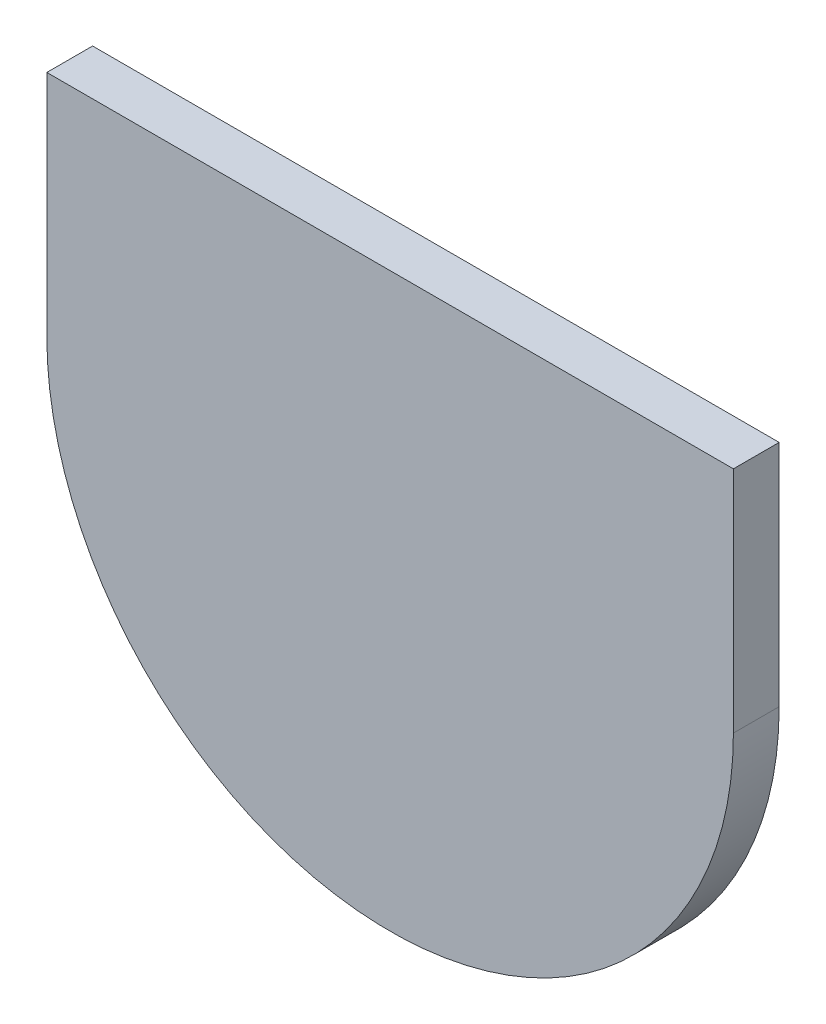
ISO-10303-21;
HEADER;
FILE_DESCRIPTION(('STEP AP214'),'2;1');
FILE_NAME('part.step','',(''),(''),'','','');
FILE_SCHEMA(('AUTOMOTIVE_DESIGN { 1 0 10303 214 1 1 1 1 }'));
ENDSEC;
DATA;
#1=APPLICATION_CONTEXT('core data for automotive mechanical design processes');
#2=APPLICATION_PROTOCOL_DEFINITION('international standard','automotive_design',2000,#1);
#3=PRODUCT_CONTEXT('',#1,'mechanical');
#4=PRODUCT('Part','Part','',(#3));
#5=PRODUCT_RELATED_PRODUCT_CATEGORY('part','',(#4));
#6=PRODUCT_DEFINITION_FORMATION('','',#4);
#7=PRODUCT_DEFINITION_CONTEXT('part definition',#1,'design');
#8=PRODUCT_DEFINITION('design','',#6,#7);
#9=PRODUCT_DEFINITION_SHAPE('','',#8);
#10=(LENGTH_UNIT() NAMED_UNIT(*) SI_UNIT(.MILLI.,.METRE.));
#11=(NAMED_UNIT(*) PLANE_ANGLE_UNIT() SI_UNIT($,.RADIAN.));
#12=(NAMED_UNIT(*) SI_UNIT($,.STERADIAN.) SOLID_ANGLE_UNIT());
#13=UNCERTAINTY_MEASURE_WITH_UNIT(LENGTH_MEASURE(1.E-05),#10,'distance_accuracy_value','');
#14=(GEOMETRIC_REPRESENTATION_CONTEXT(3) GLOBAL_UNCERTAINTY_ASSIGNED_CONTEXT((#13)) GLOBAL_UNIT_ASSIGNED_CONTEXT((#10,
#11,#12)) REPRESENTATION_CONTEXT('',''));
#15=CARTESIAN_POINT('',(0.,0.,0.));
#16=DIRECTION('',(0.,0.,1.));
#17=DIRECTION('',(1.,0.,0.));
#18=AXIS2_PLACEMENT_3D('',#15,#16,#17);
#19=CARTESIAN_POINT('',(-12.5,0.,-1.));
#20=DIRECTION('',(1.,0.,0.));
#21=DIRECTION('',(0.,1.,0.));
#22=AXIS2_PLACEMENT_3D('',#19,#20,#21);
#23=PLANE('',#22);
#24=DIRECTION('',(0.,1.,0.));
#25=VECTOR('',#24,1.);
#26=CARTESIAN_POINT('',(-12.5,0.,0.));
#27=LINE('',#26,#25);
#28=CARTESIAN_POINT('',(-12.5,-5.,0.));
#29=VERTEX_POINT('',#28);
#30=CARTESIAN_POINT('',(-12.5,0.,0.));
#31=VERTEX_POINT('',#30);
#32=EDGE_CURVE('E99',#29,#31,#27,.T.);
#33=ORIENTED_EDGE('',*,*,#32,.F.);
#34=DIRECTION('',(0.,0.,1.));
#35=VECTOR('',#34,1.);
#36=CARTESIAN_POINT('',(-12.5,-5.,-1.));
#37=LINE('',#36,#35);
#38=CARTESIAN_POINT('',(-12.5,-5.,-1.));
#39=VERTEX_POINT('',#38);
#40=EDGE_CURVE('E11',#39,#29,#37,.T.);
#41=ORIENTED_EDGE('',*,*,#40,.F.);
#42=DIRECTION('',(0.,1.,0.));
#43=VECTOR('',#42,1.);
#44=CARTESIAN_POINT('',(-12.5,0.,-1.));
#45=LINE('',#44,#43);
#46=CARTESIAN_POINT('',(-12.5,0.,-1.));
#47=VERTEX_POINT('',#46);
#48=EDGE_CURVE('E93',#39,#47,#45,.T.);
#49=ORIENTED_EDGE('',*,*,#48,.T.);
#50=DIRECTION('',(0.,0.,1.));
#51=VECTOR('',#50,1.);
#52=CARTESIAN_POINT('',(-12.5,0.,-1.));
#53=LINE('',#52,#51);
#54=EDGE_CURVE('E38',#47,#31,#53,.T.);
#55=ORIENTED_EDGE('',*,*,#54,.T.);
#56=EDGE_LOOP('',(#33,#41,#49,#55));
#57=FACE_BOUND('',#56,.T.);
#58=ADVANCED_FACE('F35',(#57),#23,.T.);
#59=CARTESIAN_POINT('',(-20.,-5.,-1.));
#60=DIRECTION('',(0.,0.,1.));
#61=DIRECTION('',(1.,0.,0.));
#62=AXIS2_PLACEMENT_3D('',#59,#60,#61);
#63=CYLINDRICAL_SURFACE('',#62,7.5);
#64=CARTESIAN_POINT('',(-20.,-5.,0.));
#65=DIRECTION('',(0.,0.,1.));
#66=DIRECTION('',(-1.,0.,0.));
#67=AXIS2_PLACEMENT_3D('',#64,#65,#66);
#68=CIRCLE('',#67,7.5);
#69=CARTESIAN_POINT('',(-27.5,-5.,0.));
#70=VERTEX_POINT('',#69);
#71=EDGE_CURVE('E95',#70,#29,#68,.T.);
#72=ORIENTED_EDGE('',*,*,#71,.F.);
#73=DIRECTION('',(0.,0.,1.));
#74=VECTOR('',#73,1.);
#75=CARTESIAN_POINT('',(-27.5,-5.,-1.));
#76=LINE('',#75,#74);
#77=CARTESIAN_POINT('',(-27.5,-5.,-1.));
#78=VERTEX_POINT('',#77);
#79=EDGE_CURVE('E44',#78,#70,#76,.T.);
#80=ORIENTED_EDGE('',*,*,#79,.F.);
#81=CARTESIAN_POINT('',(-20.,-5.,-1.));
#82=DIRECTION('',(0.,0.,1.));
#83=DIRECTION('',(-1.,0.,0.));
#84=AXIS2_PLACEMENT_3D('',#81,#82,#83);
#85=CIRCLE('',#84,7.5);
#86=EDGE_CURVE('E90',#78,#39,#85,.T.);
#87=ORIENTED_EDGE('',*,*,#86,.T.);
#88=ORIENTED_EDGE('',*,*,#40,.T.);
#89=EDGE_LOOP('',(#72,#80,#87,#88));
#90=FACE_BOUND('',#89,.T.);
#91=ADVANCED_FACE('F109',(#90),#63,.T.);
#92=CARTESIAN_POINT('',(-27.5,0.,-1.));
#93=DIRECTION('',(-1.,0.,0.));
#94=DIRECTION('',(0.,0.,1.));
#95=AXIS2_PLACEMENT_3D('',#92,#93,#94);
#96=PLANE('',#95);
#97=DIRECTION('',(0.,-1.,0.));
#98=VECTOR('',#97,1.);
#99=CARTESIAN_POINT('',(-27.5,0.,0.));
#100=LINE('',#99,#98);
#101=CARTESIAN_POINT('',(-27.5,0.,0.));
#102=VERTEX_POINT('',#101);
#103=EDGE_CURVE('E85',#102,#70,#100,.T.);
#104=ORIENTED_EDGE('',*,*,#103,.F.);
#105=DIRECTION('',(0.,0.,1.));
#106=VECTOR('',#105,1.);
#107=CARTESIAN_POINT('',(-27.5,0.,-1.));
#108=LINE('',#107,#106);
#109=CARTESIAN_POINT('',(-27.5,0.,-1.));
#110=VERTEX_POINT('',#109);
#111=EDGE_CURVE('E80',#110,#102,#108,.T.);
#112=ORIENTED_EDGE('',*,*,#111,.F.);
#113=DIRECTION('',(0.,-1.,0.));
#114=VECTOR('',#113,1.);
#115=CARTESIAN_POINT('',(-27.5,0.,-1.));
#116=LINE('',#115,#114);
#117=EDGE_CURVE('E83',#110,#78,#116,.T.);
#118=ORIENTED_EDGE('',*,*,#117,.T.);
#119=ORIENTED_EDGE('',*,*,#79,.T.);
#120=EDGE_LOOP('',(#104,#112,#118,#119));
#121=FACE_BOUND('',#120,.T.);
#122=ADVANCED_FACE('F82',(#121),#96,.T.);
#123=CARTESIAN_POINT('',(-12.5,0.,-1.));
#124=DIRECTION('',(0.,1.,0.));
#125=DIRECTION('',(-1.,0.,0.));
#126=AXIS2_PLACEMENT_3D('',#123,#124,#125);
#127=PLANE('',#126);
#128=DIRECTION('',(-1.,0.,0.));
#129=VECTOR('',#128,1.);
#130=CARTESIAN_POINT('',(-12.5,0.,0.));
#131=LINE('',#130,#129);
#132=EDGE_CURVE('E102',#31,#102,#131,.T.);
#133=ORIENTED_EDGE('',*,*,#132,.F.);
#134=ORIENTED_EDGE('',*,*,#54,.F.);
#135=DIRECTION('',(-1.,0.,0.));
#136=VECTOR('',#135,1.);
#137=CARTESIAN_POINT('',(-12.5,0.,-1.));
#138=LINE('',#137,#136);
#139=EDGE_CURVE('E89',#47,#110,#138,.T.);
#140=ORIENTED_EDGE('',*,*,#139,.T.);
#141=ORIENTED_EDGE('',*,*,#111,.T.);
#142=EDGE_LOOP('',(#133,#134,#140,#141));
#143=FACE_BOUND('',#142,.T.);
#144=ADVANCED_FACE('F92',(#143),#127,.T.);
#145=CARTESIAN_POINT('',(-20.,-5.,-1.));
#146=DIRECTION('',(0.,0.,-1.));
#147=DIRECTION('',(-1.,0.,0.));
#148=AXIS2_PLACEMENT_3D('',#145,#146,#147);
#149=PLANE('',#148);
#150=ORIENTED_EDGE('',*,*,#48,.F.);
#151=ORIENTED_EDGE('',*,*,#86,.F.);
#152=ORIENTED_EDGE('',*,*,#117,.F.);
#153=ORIENTED_EDGE('',*,*,#139,.F.);
#154=EDGE_LOOP('',(#150,#151,#152,#153));
#155=FACE_BOUND('',#154,.T.);
#156=ADVANCED_FACE('F88',(#155),#149,.T.);
#157=CARTESIAN_POINT('',(-20.,-5.,0.));
#158=DIRECTION('',(0.,0.,-1.));
#159=DIRECTION('',(-1.,0.,0.));
#160=AXIS2_PLACEMENT_3D('',#157,#158,#159);
#161=PLANE('',#160);
#162=ORIENTED_EDGE('',*,*,#32,.T.);
#163=ORIENTED_EDGE('',*,*,#132,.T.);
#164=ORIENTED_EDGE('',*,*,#103,.T.);
#165=ORIENTED_EDGE('',*,*,#71,.T.);
#166=EDGE_LOOP('',(#162,#163,#164,#165));
#167=FACE_BOUND('',#166,.T.);
#168=ADVANCED_FACE('F108',(#167),#161,.F.);
#169=CLOSED_SHELL('',(#58,#91,#122,#144,#156,#168));
#170=MANIFOLD_SOLID_BREP('B2',#169);
#171=ADVANCED_BREP_SHAPE_REPRESENTATION('',(#18,#170),#14);
#172=SHAPE_DEFINITION_REPRESENTATION(#9,#171);
ENDSEC;
END-ISO-10303-21;
